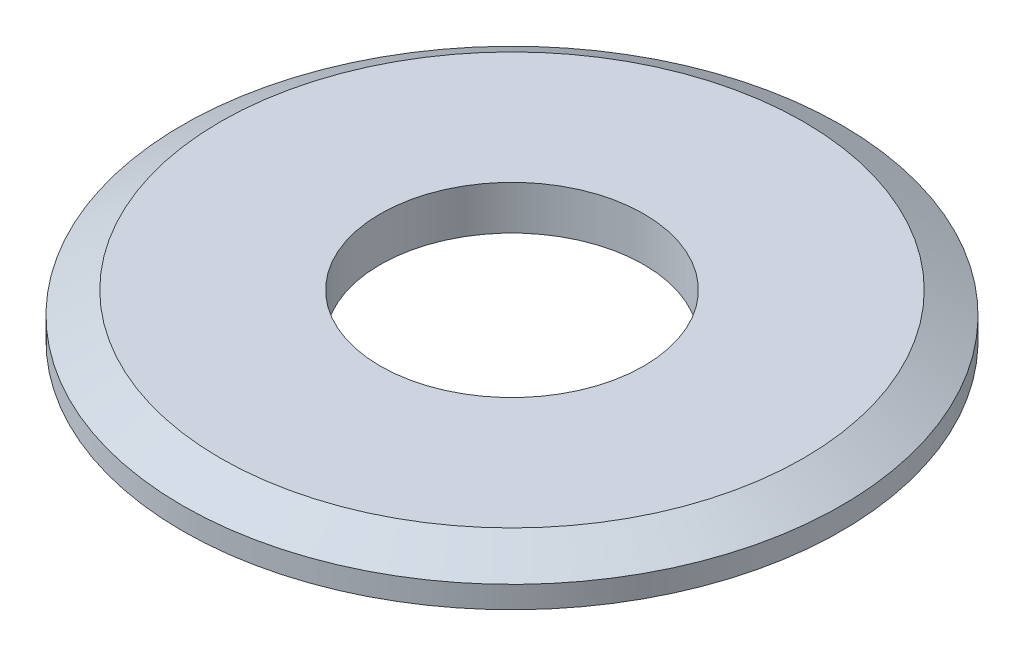
ISO-10303-21;
HEADER;
FILE_DESCRIPTION(('STEP AP214'),'2;1');
FILE_NAME('part.step','',(''),(''),'','','');
FILE_SCHEMA(('AUTOMOTIVE_DESIGN { 1 0 10303 214 1 1 1 1 }'));
ENDSEC;
DATA;
#1=APPLICATION_CONTEXT('core data for automotive mechanical design processes');
#2=APPLICATION_PROTOCOL_DEFINITION('international standard','automotive_design',2000,#1);
#3=PRODUCT_CONTEXT('',#1,'mechanical');
#4=PRODUCT('Part','Part','',(#3));
#5=PRODUCT_RELATED_PRODUCT_CATEGORY('part','',(#4));
#6=PRODUCT_DEFINITION_FORMATION('','',#4);
#7=PRODUCT_DEFINITION_CONTEXT('part definition',#1,'design');
#8=PRODUCT_DEFINITION('design','',#6,#7);
#9=PRODUCT_DEFINITION_SHAPE('','',#8);
#10=(LENGTH_UNIT() NAMED_UNIT(*) SI_UNIT(.MILLI.,.METRE.));
#11=(NAMED_UNIT(*) PLANE_ANGLE_UNIT() SI_UNIT($,.RADIAN.));
#12=(NAMED_UNIT(*) SI_UNIT($,.STERADIAN.) SOLID_ANGLE_UNIT());
#13=UNCERTAINTY_MEASURE_WITH_UNIT(LENGTH_MEASURE(1.E-05),#10,'distance_accuracy_value','');
#14=(GEOMETRIC_REPRESENTATION_CONTEXT(3) GLOBAL_UNCERTAINTY_ASSIGNED_CONTEXT((#13)) GLOBAL_UNIT_ASSIGNED_CONTEXT((#10,
#11,#12)) REPRESENTATION_CONTEXT('',''));
#15=CARTESIAN_POINT('',(0.,0.,0.));
#16=DIRECTION('',(0.,0.,1.));
#17=DIRECTION('',(1.,0.,0.));
#18=AXIS2_PLACEMENT_3D('',#15,#16,#17);
#19=CARTESIAN_POINT('',(0.,1.,0.));
#20=DIRECTION('',(0.,-1.,0.));
#21=DIRECTION('',(0.,0.,-1.));
#22=AXIS2_PLACEMENT_3D('',#19,#20,#21);
#23=CYLINDRICAL_SURFACE('',#22,7.5);
#24=CARTESIAN_POINT('',(0.,0.499999999999999,0.));
#25=DIRECTION('',(0.,1.,0.));
#26=DIRECTION('',(0.,0.,1.));
#27=AXIS2_PLACEMENT_3D('',#24,#25,#26);
#28=CIRCLE('',#27,7.5);
#29=CARTESIAN_POINT('',(0.,0.499999999999999,7.5));
#30=VERTEX_POINT('',#29);
#31=EDGE_CURVE('E10',#30,#30,#28,.F.);
#32=ORIENTED_EDGE('',*,*,#31,.T.);
#33=EDGE_LOOP('',(#32));
#34=FACE_BOUND('',#33,.T.);
#35=CARTESIAN_POINT('',(0.,0.,0.));
#36=DIRECTION('',(0.,1.,0.));
#37=DIRECTION('',(0.,0.,1.));
#38=AXIS2_PLACEMENT_3D('',#35,#36,#37);
#39=CIRCLE('',#38,7.5);
#40=CARTESIAN_POINT('',(0.,0.,7.5));
#41=VERTEX_POINT('',#40);
#42=EDGE_CURVE('E54',#41,#41,#39,.T.);
#43=ORIENTED_EDGE('',*,*,#42,.T.);
#44=EDGE_LOOP('',(#43));
#45=FACE_BOUND('',#44,.T.);
#46=ADVANCED_FACE('F42',(#34,#45),#23,.T.);
#47=CARTESIAN_POINT('',(0.,1.,0.));
#48=DIRECTION('',(0.,1.,0.));
#49=DIRECTION('',(0.,0.,1.));
#50=AXIS2_PLACEMENT_3D('',#47,#48,#49);
#51=PLANE('',#50);
#52=CARTESIAN_POINT('',(0.,1.,0.));
#53=DIRECTION('',(0.,1.,0.));
#54=DIRECTION('',(0.,0.,1.));
#55=AXIS2_PLACEMENT_3D('',#52,#53,#54);
#56=CIRCLE('',#55,3.);
#57=CARTESIAN_POINT('',(0.,1.,3.));
#58=VERTEX_POINT('',#57);
#59=EDGE_CURVE('E61',#58,#58,#56,.T.);
#60=ORIENTED_EDGE('',*,*,#59,.F.);
#61=EDGE_LOOP('',(#60));
#62=FACE_BOUND('',#61,.T.);
#63=CARTESIAN_POINT('',(0.,1.,0.));
#64=DIRECTION('',(0.,1.,0.));
#65=DIRECTION('',(0.,0.,1.));
#66=AXIS2_PLACEMENT_3D('',#63,#64,#65);
#67=CIRCLE('',#66,6.63397459621556);
#68=CARTESIAN_POINT('',(0.,1.,6.63397459621556));
#69=VERTEX_POINT('',#68);
#70=EDGE_CURVE('E50',#69,#69,#67,.T.);
#71=ORIENTED_EDGE('',*,*,#70,.T.);
#72=EDGE_LOOP('',(#71));
#73=FACE_BOUND('',#72,.T.);
#74=ADVANCED_FACE('F76',(#62,#73),#51,.T.);
#75=CARTESIAN_POINT('',(0.,0.,0.));
#76=DIRECTION('',(0.,1.,0.));
#77=DIRECTION('',(0.,0.,1.));
#78=AXIS2_PLACEMENT_3D('',#75,#76,#77);
#79=PLANE('',#78);
#80=CARTESIAN_POINT('',(0.,0.,0.));
#81=DIRECTION('',(0.,1.,0.));
#82=DIRECTION('',(0.,0.,1.));
#83=AXIS2_PLACEMENT_3D('',#80,#81,#82);
#84=CIRCLE('',#83,3.);
#85=CARTESIAN_POINT('',(0.,0.,3.));
#86=VERTEX_POINT('',#85);
#87=EDGE_CURVE('E58',#86,#86,#84,.T.);
#88=ORIENTED_EDGE('',*,*,#87,.T.);
#89=EDGE_LOOP('',(#88));
#90=FACE_BOUND('',#89,.T.);
#91=ORIENTED_EDGE('',*,*,#42,.F.);
#92=EDGE_LOOP('',(#91));
#93=FACE_BOUND('',#92,.T.);
#94=ADVANCED_FACE('F67',(#90,#93),#79,.F.);
#95=CARTESIAN_POINT('',(0.,1.,0.));
#96=DIRECTION('',(0.,-1.,0.));
#97=DIRECTION('',(0.,0.,-1.));
#98=AXIS2_PLACEMENT_3D('',#95,#96,#97);
#99=CONICAL_SURFACE('',#98,6.63397459621556,1.0471975511966);
#100=ORIENTED_EDGE('',*,*,#31,.F.);
#101=EDGE_LOOP('',(#100));
#102=FACE_BOUND('',#101,.T.);
#103=ORIENTED_EDGE('',*,*,#70,.F.);
#104=EDGE_LOOP('',(#103));
#105=FACE_BOUND('',#104,.T.);
#106=ADVANCED_FACE('F45',(#102,#105),#99,.T.);
#107=CARTESIAN_POINT('',(0.,0.,0.));
#108=DIRECTION('',(0.,1.,0.));
#109=DIRECTION('',(0.,0.,1.));
#110=AXIS2_PLACEMENT_3D('',#107,#108,#109);
#111=CYLINDRICAL_SURFACE('',#110,3.);
#112=ORIENTED_EDGE('',*,*,#87,.F.);
#113=EDGE_LOOP('',(#112));
#114=FACE_BOUND('',#113,.T.);
#115=ORIENTED_EDGE('',*,*,#59,.T.);
#116=EDGE_LOOP('',(#115));
#117=FACE_BOUND('',#116,.T.);
#118=ADVANCED_FACE('F70',(#114,#117),#111,.F.);
#119=CLOSED_SHELL('',(#46,#74,#94,#106,#118));
#120=MANIFOLD_SOLID_BREP('B2',#119);
#121=ADVANCED_BREP_SHAPE_REPRESENTATION('',(#18,#120),#14);
#122=SHAPE_DEFINITION_REPRESENTATION(#9,#121);
ENDSEC;
END-ISO-10303-21;
